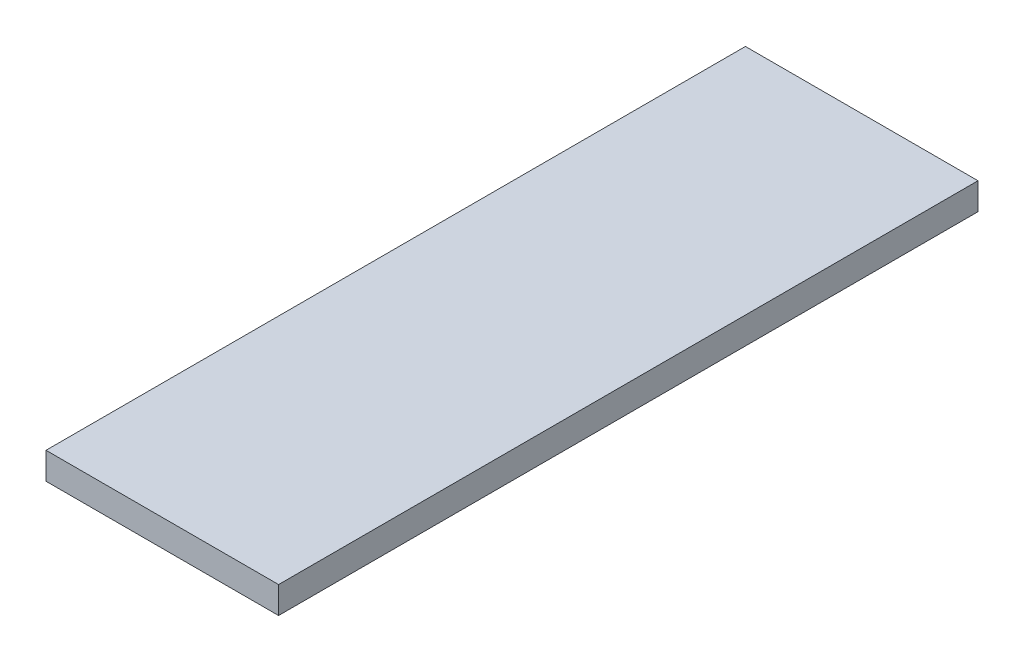
ISO-10303-21;
HEADER;
FILE_DESCRIPTION(('STEP AP214'),'2;1');
FILE_NAME('part.step','',(''),(''),'','','');
FILE_SCHEMA(('AUTOMOTIVE_DESIGN { 1 0 10303 214 1 1 1 1 }'));
ENDSEC;
DATA;
#1=APPLICATION_CONTEXT('core data for automotive mechanical design processes');
#2=APPLICATION_PROTOCOL_DEFINITION('international standard','automotive_design',2000,#1);
#3=PRODUCT_CONTEXT('',#1,'mechanical');
#4=PRODUCT('Part','Part','',(#3));
#5=PRODUCT_RELATED_PRODUCT_CATEGORY('part','',(#4));
#6=PRODUCT_DEFINITION_FORMATION('','',#4);
#7=PRODUCT_DEFINITION_CONTEXT('part definition',#1,'design');
#8=PRODUCT_DEFINITION('design','',#6,#7);
#9=PRODUCT_DEFINITION_SHAPE('','',#8);
#10=(LENGTH_UNIT() NAMED_UNIT(*) SI_UNIT(.MILLI.,.METRE.));
#11=(NAMED_UNIT(*) PLANE_ANGLE_UNIT() SI_UNIT($,.RADIAN.));
#12=(NAMED_UNIT(*) SI_UNIT($,.STERADIAN.) SOLID_ANGLE_UNIT());
#13=UNCERTAINTY_MEASURE_WITH_UNIT(LENGTH_MEASURE(1.E-05),#10,'distance_accuracy_value','');
#14=(GEOMETRIC_REPRESENTATION_CONTEXT(3) GLOBAL_UNCERTAINTY_ASSIGNED_CONTEXT((#13)) GLOBAL_UNIT_ASSIGNED_CONTEXT((#10,
#11,#12)) REPRESENTATION_CONTEXT('',''));
#15=CARTESIAN_POINT('',(0.,0.,0.));
#16=DIRECTION('',(0.,0.,1.));
#17=DIRECTION('',(1.,0.,0.));
#18=AXIS2_PLACEMENT_3D('',#15,#16,#17);
#19=CARTESIAN_POINT('',(0.,3.,0.));
#20=DIRECTION('',(1.,0.,0.));
#21=DIRECTION('',(0.,0.,-1.));
#22=AXIS2_PLACEMENT_3D('',#19,#20,#21);
#23=PLANE('',#22);
#24=DIRECTION('',(0.,0.,1.));
#25=VECTOR('',#24,1.);
#26=CARTESIAN_POINT('',(0.,0.,0.));
#27=LINE('',#26,#25);
#28=CARTESIAN_POINT('',(0.,0.,-78.19));
#29=VERTEX_POINT('',#28);
#30=CARTESIAN_POINT('',(0.,0.,0.));
#31=VERTEX_POINT('',#30);
#32=EDGE_CURVE('E99',#29,#31,#27,.T.);
#33=ORIENTED_EDGE('',*,*,#32,.T.);
#34=DIRECTION('',(0.,-1.,0.));
#35=VECTOR('',#34,1.);
#36=CARTESIAN_POINT('',(0.,3.,0.));
#37=LINE('',#36,#35);
#38=CARTESIAN_POINT('',(0.,3.,0.));
#39=VERTEX_POINT('',#38);
#40=EDGE_CURVE('E11',#39,#31,#37,.T.);
#41=ORIENTED_EDGE('',*,*,#40,.F.);
#42=DIRECTION('',(0.,0.,1.));
#43=VECTOR('',#42,1.);
#44=CARTESIAN_POINT('',(0.,3.,0.));
#45=LINE('',#44,#43);
#46=CARTESIAN_POINT('',(0.,3.,-78.19));
#47=VERTEX_POINT('',#46);
#48=EDGE_CURVE('E87',#47,#39,#45,.T.);
#49=ORIENTED_EDGE('',*,*,#48,.F.);
#50=DIRECTION('',(0.,-1.,0.));
#51=VECTOR('',#50,1.);
#52=CARTESIAN_POINT('',(0.,3.,-78.19));
#53=LINE('',#52,#51);
#54=EDGE_CURVE('E95',#47,#29,#53,.T.);
#55=ORIENTED_EDGE('',*,*,#54,.T.);
#56=EDGE_LOOP('',(#33,#41,#49,#55));
#57=FACE_BOUND('',#56,.T.);
#58=ADVANCED_FACE('F36',(#57),#23,.F.);
#59=CARTESIAN_POINT('',(0.,3.,0.));
#60=DIRECTION('',(0.,0.,-1.));
#61=DIRECTION('',(-1.,0.,0.));
#62=AXIS2_PLACEMENT_3D('',#59,#60,#61);
#63=PLANE('',#62);
#64=DIRECTION('',(1.,0.,0.));
#65=VECTOR('',#64,1.);
#66=CARTESIAN_POINT('',(0.,0.,0.));
#67=LINE('',#66,#65);
#68=CARTESIAN_POINT('',(26.,0.,0.));
#69=VERTEX_POINT('',#68);
#70=EDGE_CURVE('E91',#31,#69,#67,.T.);
#71=ORIENTED_EDGE('',*,*,#70,.T.);
#72=DIRECTION('',(0.,-1.,0.));
#73=VECTOR('',#72,1.);
#74=CARTESIAN_POINT('',(26.,3.,0.));
#75=LINE('',#74,#73);
#76=CARTESIAN_POINT('',(26.,3.,0.));
#77=VERTEX_POINT('',#76);
#78=EDGE_CURVE('E44',#77,#69,#75,.T.);
#79=ORIENTED_EDGE('',*,*,#78,.F.);
#80=DIRECTION('',(1.,0.,0.));
#81=VECTOR('',#80,1.);
#82=CARTESIAN_POINT('',(0.,3.,0.));
#83=LINE('',#82,#81);
#84=EDGE_CURVE('E82',#39,#77,#83,.T.);
#85=ORIENTED_EDGE('',*,*,#84,.F.);
#86=ORIENTED_EDGE('',*,*,#40,.T.);
#87=EDGE_LOOP('',(#71,#79,#85,#86));
#88=FACE_BOUND('',#87,.T.);
#89=ADVANCED_FACE('F90',(#88),#63,.F.);
#90=CARTESIAN_POINT('',(26.,3.,0.));
#91=DIRECTION('',(-1.,0.,0.));
#92=DIRECTION('',(0.,0.,1.));
#93=AXIS2_PLACEMENT_3D('',#90,#91,#92);
#94=PLANE('',#93);
#95=DIRECTION('',(0.,0.,-1.));
#96=VECTOR('',#95,1.);
#97=CARTESIAN_POINT('',(26.,0.,0.));
#98=LINE('',#97,#96);
#99=CARTESIAN_POINT('',(26.,0.,-78.19));
#100=VERTEX_POINT('',#99);
#101=EDGE_CURVE('E69',#69,#100,#98,.T.);
#102=ORIENTED_EDGE('',*,*,#101,.T.);
#103=DIRECTION('',(0.,-1.,0.));
#104=VECTOR('',#103,1.);
#105=CARTESIAN_POINT('',(26.,3.,-78.19));
#106=LINE('',#105,#104);
#107=CARTESIAN_POINT('',(26.,3.,-78.19));
#108=VERTEX_POINT('',#107);
#109=EDGE_CURVE('E92',#108,#100,#106,.T.);
#110=ORIENTED_EDGE('',*,*,#109,.F.);
#111=DIRECTION('',(0.,0.,-1.));
#112=VECTOR('',#111,1.);
#113=CARTESIAN_POINT('',(26.,3.,0.));
#114=LINE('',#113,#112);
#115=EDGE_CURVE('E85',#77,#108,#114,.T.);
#116=ORIENTED_EDGE('',*,*,#115,.F.);
#117=ORIENTED_EDGE('',*,*,#78,.T.);
#118=EDGE_LOOP('',(#102,#110,#116,#117));
#119=FACE_BOUND('',#118,.T.);
#120=ADVANCED_FACE('F93',(#119),#94,.F.);
#121=CARTESIAN_POINT('',(0.,3.,-78.19));
#122=DIRECTION('',(0.,0.,1.));
#123=DIRECTION('',(1.,0.,0.));
#124=AXIS2_PLACEMENT_3D('',#121,#122,#123);
#125=PLANE('',#124);
#126=DIRECTION('',(-1.,0.,0.));
#127=VECTOR('',#126,1.);
#128=CARTESIAN_POINT('',(0.,0.,-78.19));
#129=LINE('',#128,#127);
#130=EDGE_CURVE('E75',#100,#29,#129,.T.);
#131=ORIENTED_EDGE('',*,*,#130,.T.);
#132=ORIENTED_EDGE('',*,*,#54,.F.);
#133=DIRECTION('',(-1.,0.,0.));
#134=VECTOR('',#133,1.);
#135=CARTESIAN_POINT('',(0.,3.,-78.19));
#136=LINE('',#135,#134);
#137=EDGE_CURVE('E52',#108,#47,#136,.T.);
#138=ORIENTED_EDGE('',*,*,#137,.F.);
#139=ORIENTED_EDGE('',*,*,#109,.T.);
#140=EDGE_LOOP('',(#131,#132,#138,#139));
#141=FACE_BOUND('',#140,.T.);
#142=ADVANCED_FACE('F106',(#141),#125,.F.);
#143=CARTESIAN_POINT('',(0.,3.,0.));
#144=DIRECTION('',(0.,-1.,0.));
#145=DIRECTION('',(0.,0.,-1.));
#146=AXIS2_PLACEMENT_3D('',#143,#144,#145);
#147=PLANE('',#146);
#148=ORIENTED_EDGE('',*,*,#48,.T.);
#149=ORIENTED_EDGE('',*,*,#84,.T.);
#150=ORIENTED_EDGE('',*,*,#115,.T.);
#151=ORIENTED_EDGE('',*,*,#137,.T.);
#152=EDGE_LOOP('',(#148,#149,#150,#151));
#153=FACE_BOUND('',#152,.T.);
#154=ADVANCED_FACE('F83',(#153),#147,.F.);
#155=CARTESIAN_POINT('',(0.,0.,0.));
#156=DIRECTION('',(0.,-1.,0.));
#157=DIRECTION('',(0.,0.,-1.));
#158=AXIS2_PLACEMENT_3D('',#155,#156,#157);
#159=PLANE('',#158);
#160=ORIENTED_EDGE('',*,*,#32,.F.);
#161=ORIENTED_EDGE('',*,*,#130,.F.);
#162=ORIENTED_EDGE('',*,*,#101,.F.);
#163=ORIENTED_EDGE('',*,*,#70,.F.);
#164=EDGE_LOOP('',(#160,#161,#162,#163));
#165=FACE_BOUND('',#164,.T.);
#166=ADVANCED_FACE('F109',(#165),#159,.T.);
#167=CLOSED_SHELL('',(#58,#89,#120,#142,#154,#166));
#168=MANIFOLD_SOLID_BREP('B2',#167);
#169=ADVANCED_BREP_SHAPE_REPRESENTATION('',(#18,#168),#14);
#170=SHAPE_DEFINITION_REPRESENTATION(#9,#169);
ENDSEC;
END-ISO-10303-21;
